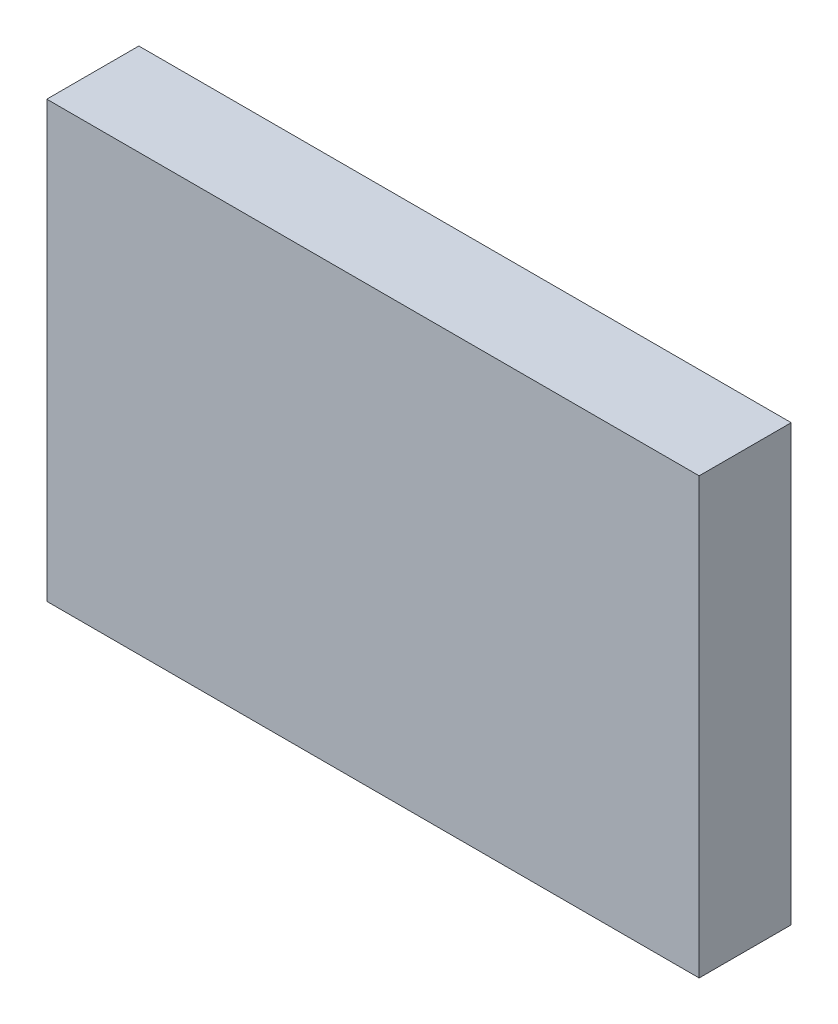
ISO-10303-21;
HEADER;
FILE_DESCRIPTION(('STEP AP214'),'2;1');
FILE_NAME('part.step','',(''),(''),'','','');
FILE_SCHEMA(('AUTOMOTIVE_DESIGN { 1 0 10303 214 1 1 1 1 }'));
ENDSEC;
DATA;
#1=APPLICATION_CONTEXT('core data for automotive mechanical design processes');
#2=APPLICATION_PROTOCOL_DEFINITION('international standard','automotive_design',2000,#1);
#3=PRODUCT_CONTEXT('',#1,'mechanical');
#4=PRODUCT('Part','Part','',(#3));
#5=PRODUCT_RELATED_PRODUCT_CATEGORY('part','',(#4));
#6=PRODUCT_DEFINITION_FORMATION('','',#4);
#7=PRODUCT_DEFINITION_CONTEXT('part definition',#1,'design');
#8=PRODUCT_DEFINITION('design','',#6,#7);
#9=PRODUCT_DEFINITION_SHAPE('','',#8);
#10=(LENGTH_UNIT() NAMED_UNIT(*) SI_UNIT(.MILLI.,.METRE.));
#11=(NAMED_UNIT(*) PLANE_ANGLE_UNIT() SI_UNIT($,.RADIAN.));
#12=(NAMED_UNIT(*) SI_UNIT($,.STERADIAN.) SOLID_ANGLE_UNIT());
#13=UNCERTAINTY_MEASURE_WITH_UNIT(LENGTH_MEASURE(1.E-05),#10,'distance_accuracy_value','');
#14=(GEOMETRIC_REPRESENTATION_CONTEXT(3) GLOBAL_UNCERTAINTY_ASSIGNED_CONTEXT((#13)) GLOBAL_UNIT_ASSIGNED_CONTEXT((#10,
#11,#12)) REPRESENTATION_CONTEXT('',''));
#15=CARTESIAN_POINT('',(0.,0.,0.));
#16=DIRECTION('',(0.,0.,1.));
#17=DIRECTION('',(1.,0.,0.));
#18=AXIS2_PLACEMENT_3D('',#15,#16,#17);
#19=CARTESIAN_POINT('',(0.,0.,6.35));
#20=DIRECTION('',(1.,0.,0.));
#21=DIRECTION('',(0.,0.,-1.));
#22=AXIS2_PLACEMENT_3D('',#19,#20,#21);
#23=PLANE('',#22);
#24=DIRECTION('',(0.,-1.,0.));
#25=VECTOR('',#24,1.);
#26=CARTESIAN_POINT('',(0.,0.,0.));
#27=LINE('',#26,#25);
#28=CARTESIAN_POINT('',(0.,30.,0.));
#29=VERTEX_POINT('',#28);
#30=CARTESIAN_POINT('',(0.,0.,0.));
#31=VERTEX_POINT('',#30);
#32=EDGE_CURVE('E96',#29,#31,#27,.T.);
#33=ORIENTED_EDGE('',*,*,#32,.T.);
#34=DIRECTION('',(0.,0.,-1.));
#35=VECTOR('',#34,1.);
#36=CARTESIAN_POINT('',(0.,0.,6.35));
#37=LINE('',#36,#35);
#38=CARTESIAN_POINT('',(0.,0.,6.35));
#39=VERTEX_POINT('',#38);
#40=EDGE_CURVE('E11',#39,#31,#37,.T.);
#41=ORIENTED_EDGE('',*,*,#40,.F.);
#42=DIRECTION('',(0.,-1.,0.));
#43=VECTOR('',#42,1.);
#44=CARTESIAN_POINT('',(0.,0.,6.35));
#45=LINE('',#44,#43);
#46=CARTESIAN_POINT('',(0.,30.,6.35));
#47=VERTEX_POINT('',#46);
#48=EDGE_CURVE('E84',#47,#39,#45,.T.);
#49=ORIENTED_EDGE('',*,*,#48,.F.);
#50=DIRECTION('',(0.,0.,-1.));
#51=VECTOR('',#50,1.);
#52=CARTESIAN_POINT('',(0.,30.,6.35));
#53=LINE('',#52,#51);
#54=EDGE_CURVE('E92',#47,#29,#53,.T.);
#55=ORIENTED_EDGE('',*,*,#54,.T.);
#56=EDGE_LOOP('',(#33,#41,#49,#55));
#57=FACE_BOUND('',#56,.T.);
#58=ADVANCED_FACE('F33',(#57),#23,.F.);
#59=CARTESIAN_POINT('',(0.,0.,6.35));
#60=DIRECTION('',(0.,1.,0.));
#61=DIRECTION('',(0.,0.,1.));
#62=AXIS2_PLACEMENT_3D('',#59,#60,#61);
#63=PLANE('',#62);
#64=DIRECTION('',(1.,0.,0.));
#65=VECTOR('',#64,1.);
#66=CARTESIAN_POINT('',(0.,0.,0.));
#67=LINE('',#66,#65);
#68=CARTESIAN_POINT('',(45.,0.,0.));
#69=VERTEX_POINT('',#68);
#70=EDGE_CURVE('E88',#31,#69,#67,.T.);
#71=ORIENTED_EDGE('',*,*,#70,.T.);
#72=DIRECTION('',(0.,0.,-1.));
#73=VECTOR('',#72,1.);
#74=CARTESIAN_POINT('',(45.,0.,6.35));
#75=LINE('',#74,#73);
#76=CARTESIAN_POINT('',(45.,0.,6.35));
#77=VERTEX_POINT('',#76);
#78=EDGE_CURVE('E41',#77,#69,#75,.T.);
#79=ORIENTED_EDGE('',*,*,#78,.F.);
#80=DIRECTION('',(1.,0.,0.));
#81=VECTOR('',#80,1.);
#82=CARTESIAN_POINT('',(0.,0.,6.35));
#83=LINE('',#82,#81);
#84=EDGE_CURVE('E79',#39,#77,#83,.T.);
#85=ORIENTED_EDGE('',*,*,#84,.F.);
#86=ORIENTED_EDGE('',*,*,#40,.T.);
#87=EDGE_LOOP('',(#71,#79,#85,#86));
#88=FACE_BOUND('',#87,.T.);
#89=ADVANCED_FACE('F87',(#88),#63,.F.);
#90=CARTESIAN_POINT('',(45.,0.,6.35));
#91=DIRECTION('',(-1.,0.,0.));
#92=DIRECTION('',(0.,0.,1.));
#93=AXIS2_PLACEMENT_3D('',#90,#91,#92);
#94=PLANE('',#93);
#95=DIRECTION('',(0.,1.,0.));
#96=VECTOR('',#95,1.);
#97=CARTESIAN_POINT('',(45.,0.,0.));
#98=LINE('',#97,#96);
#99=CARTESIAN_POINT('',(45.,30.,0.));
#100=VERTEX_POINT('',#99);
#101=EDGE_CURVE('E66',#69,#100,#98,.T.);
#102=ORIENTED_EDGE('',*,*,#101,.T.);
#103=DIRECTION('',(0.,0.,-1.));
#104=VECTOR('',#103,1.);
#105=CARTESIAN_POINT('',(45.,30.,6.35));
#106=LINE('',#105,#104);
#107=CARTESIAN_POINT('',(45.,30.,6.35));
#108=VERTEX_POINT('',#107);
#109=EDGE_CURVE('E89',#108,#100,#106,.T.);
#110=ORIENTED_EDGE('',*,*,#109,.F.);
#111=DIRECTION('',(0.,1.,0.));
#112=VECTOR('',#111,1.);
#113=CARTESIAN_POINT('',(45.,0.,6.35));
#114=LINE('',#113,#112);
#115=EDGE_CURVE('E82',#77,#108,#114,.T.);
#116=ORIENTED_EDGE('',*,*,#115,.F.);
#117=ORIENTED_EDGE('',*,*,#78,.T.);
#118=EDGE_LOOP('',(#102,#110,#116,#117));
#119=FACE_BOUND('',#118,.T.);
#120=ADVANCED_FACE('F90',(#119),#94,.F.);
#121=CARTESIAN_POINT('',(0.,30.,6.35));
#122=DIRECTION('',(0.,-1.,0.));
#123=DIRECTION('',(0.,0.,-1.));
#124=AXIS2_PLACEMENT_3D('',#121,#122,#123);
#125=PLANE('',#124);
#126=DIRECTION('',(-1.,0.,0.));
#127=VECTOR('',#126,1.);
#128=CARTESIAN_POINT('',(0.,30.,0.));
#129=LINE('',#128,#127);
#130=EDGE_CURVE('E72',#100,#29,#129,.T.);
#131=ORIENTED_EDGE('',*,*,#130,.T.);
#132=ORIENTED_EDGE('',*,*,#54,.F.);
#133=DIRECTION('',(-1.,0.,0.));
#134=VECTOR('',#133,1.);
#135=CARTESIAN_POINT('',(0.,30.,6.35));
#136=LINE('',#135,#134);
#137=EDGE_CURVE('E49',#108,#47,#136,.T.);
#138=ORIENTED_EDGE('',*,*,#137,.F.);
#139=ORIENTED_EDGE('',*,*,#109,.T.);
#140=EDGE_LOOP('',(#131,#132,#138,#139));
#141=FACE_BOUND('',#140,.T.);
#142=ADVANCED_FACE('F103',(#141),#125,.F.);
#143=CARTESIAN_POINT('',(0.,30.,6.35));
#144=DIRECTION('',(0.,0.,-1.));
#145=DIRECTION('',(-1.,0.,0.));
#146=AXIS2_PLACEMENT_3D('',#143,#144,#145);
#147=PLANE('',#146);
#148=ORIENTED_EDGE('',*,*,#48,.T.);
#149=ORIENTED_EDGE('',*,*,#84,.T.);
#150=ORIENTED_EDGE('',*,*,#115,.T.);
#151=ORIENTED_EDGE('',*,*,#137,.T.);
#152=EDGE_LOOP('',(#148,#149,#150,#151));
#153=FACE_BOUND('',#152,.T.);
#154=ADVANCED_FACE('F80',(#153),#147,.F.);
#155=CARTESIAN_POINT('',(0.,30.,0.));
#156=DIRECTION('',(0.,0.,-1.));
#157=DIRECTION('',(-1.,0.,0.));
#158=AXIS2_PLACEMENT_3D('',#155,#156,#157);
#159=PLANE('',#158);
#160=ORIENTED_EDGE('',*,*,#32,.F.);
#161=ORIENTED_EDGE('',*,*,#130,.F.);
#162=ORIENTED_EDGE('',*,*,#101,.F.);
#163=ORIENTED_EDGE('',*,*,#70,.F.);
#164=EDGE_LOOP('',(#160,#161,#162,#163));
#165=FACE_BOUND('',#164,.T.);
#166=ADVANCED_FACE('F106',(#165),#159,.T.);
#167=CLOSED_SHELL('',(#58,#89,#120,#142,#154,#166));
#168=MANIFOLD_SOLID_BREP('B2',#167);
#169=ADVANCED_BREP_SHAPE_REPRESENTATION('',(#18,#168),#14);
#170=SHAPE_DEFINITION_REPRESENTATION(#9,#169);
ENDSEC;
END-ISO-10303-21;
